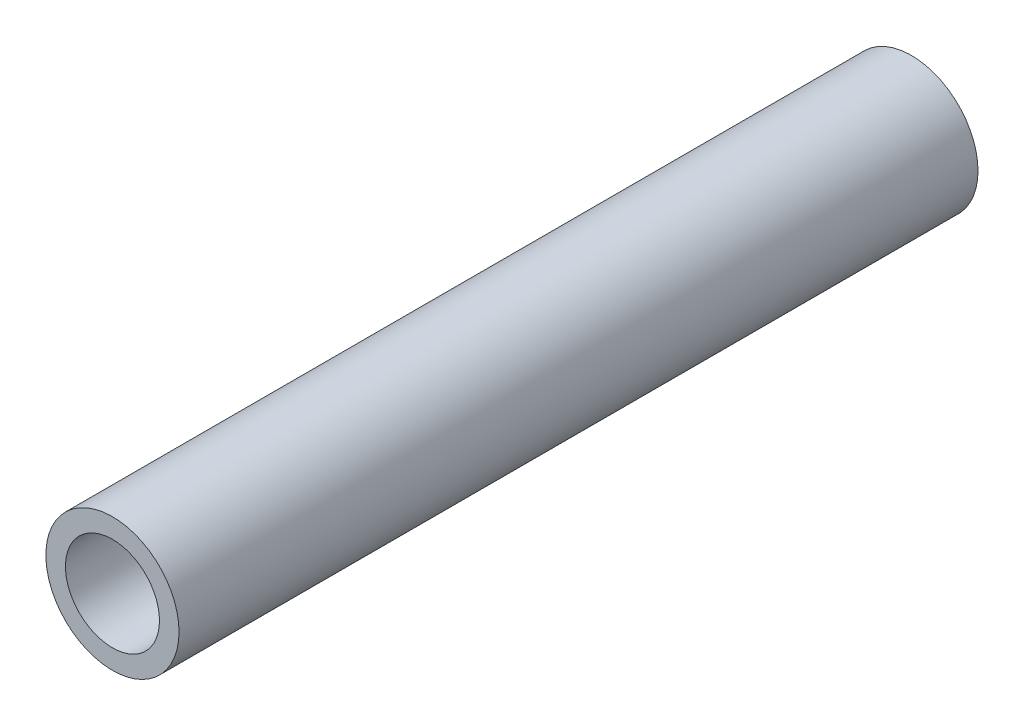
ISO-10303-21;
HEADER;
FILE_DESCRIPTION(('STEP AP214'),'2;1');
FILE_NAME('part.step','',(''),(''),'','','');
FILE_SCHEMA(('AUTOMOTIVE_DESIGN { 1 0 10303 214 1 1 1 1 }'));
ENDSEC;
DATA;
#1=APPLICATION_CONTEXT('core data for automotive mechanical design processes');
#2=APPLICATION_PROTOCOL_DEFINITION('international standard','automotive_design',2000,#1);
#3=PRODUCT_CONTEXT('',#1,'mechanical');
#4=PRODUCT('Part','Part','',(#3));
#5=PRODUCT_RELATED_PRODUCT_CATEGORY('part','',(#4));
#6=PRODUCT_DEFINITION_FORMATION('','',#4);
#7=PRODUCT_DEFINITION_CONTEXT('part definition',#1,'design');
#8=PRODUCT_DEFINITION('design','',#6,#7);
#9=PRODUCT_DEFINITION_SHAPE('','',#8);
#10=(LENGTH_UNIT() NAMED_UNIT(*) SI_UNIT(.MILLI.,.METRE.));
#11=(NAMED_UNIT(*) PLANE_ANGLE_UNIT() SI_UNIT($,.RADIAN.));
#12=(NAMED_UNIT(*) SI_UNIT($,.STERADIAN.) SOLID_ANGLE_UNIT());
#13=UNCERTAINTY_MEASURE_WITH_UNIT(LENGTH_MEASURE(1.E-05),#10,'distance_accuracy_value','');
#14=(GEOMETRIC_REPRESENTATION_CONTEXT(3) GLOBAL_UNCERTAINTY_ASSIGNED_CONTEXT((#13)) GLOBAL_UNIT_ASSIGNED_CONTEXT((#10,
#11,#12)) REPRESENTATION_CONTEXT('',''));
#15=CARTESIAN_POINT('',(0.,0.,0.));
#16=DIRECTION('',(0.,0.,1.));
#17=DIRECTION('',(1.,0.,0.));
#18=AXIS2_PLACEMENT_3D('',#15,#16,#17);
#19=CARTESIAN_POINT('',(0.,0.,76.2));
#20=DIRECTION('',(0.,0.,1.));
#21=DIRECTION('',(1.,0.,0.));
#22=AXIS2_PLACEMENT_3D('',#19,#20,#21);
#23=PLANE('',#22);
#24=CARTESIAN_POINT('',(0.,0.,76.2));
#25=DIRECTION('',(0.,0.,1.));
#26=DIRECTION('',(1.,0.,0.));
#27=AXIS2_PLACEMENT_3D('',#24,#25,#26);
#28=CIRCLE('',#27,6.35);
#29=CARTESIAN_POINT('',(6.35,0.,76.2));
#30=VERTEX_POINT('',#29);
#31=EDGE_CURVE('E10',#30,#30,#28,.T.);
#32=ORIENTED_EDGE('',*,*,#31,.T.);
#33=EDGE_LOOP('',(#32));
#34=FACE_BOUND('',#33,.T.);
#35=CARTESIAN_POINT('',(0.,0.,76.2));
#36=DIRECTION('',(0.,0.,1.));
#37=DIRECTION('',(1.,0.,0.));
#38=AXIS2_PLACEMENT_3D('',#35,#36,#37);
#39=CIRCLE('',#38,4.4831);
#40=CARTESIAN_POINT('',(4.4831,0.,76.2));
#41=VERTEX_POINT('',#40);
#42=EDGE_CURVE('E41',#41,#41,#39,.T.);
#43=ORIENTED_EDGE('',*,*,#42,.F.);
#44=EDGE_LOOP('',(#43));
#45=FACE_BOUND('',#44,.T.);
#46=ADVANCED_FACE('F30',(#34,#45),#23,.T.);
#47=CARTESIAN_POINT('',(0.,0.,0.));
#48=DIRECTION('',(0.,0.,1.));
#49=DIRECTION('',(1.,0.,0.));
#50=AXIS2_PLACEMENT_3D('',#47,#48,#49);
#51=PLANE('',#50);
#52=CARTESIAN_POINT('',(0.,0.,0.));
#53=DIRECTION('',(0.,0.,1.));
#54=DIRECTION('',(1.,0.,0.));
#55=AXIS2_PLACEMENT_3D('',#52,#53,#54);
#56=CIRCLE('',#55,6.35);
#57=CARTESIAN_POINT('',(6.35,0.,0.));
#58=VERTEX_POINT('',#57);
#59=EDGE_CURVE('E34',#58,#58,#56,.T.);
#60=ORIENTED_EDGE('',*,*,#59,.F.);
#61=EDGE_LOOP('',(#60));
#62=FACE_BOUND('',#61,.T.);
#63=CARTESIAN_POINT('',(0.,0.,0.));
#64=DIRECTION('',(0.,0.,1.));
#65=DIRECTION('',(1.,0.,0.));
#66=AXIS2_PLACEMENT_3D('',#63,#64,#65);
#67=CIRCLE('',#66,4.4831);
#68=CARTESIAN_POINT('',(4.4831,0.,0.));
#69=VERTEX_POINT('',#68);
#70=EDGE_CURVE('E43',#69,#69,#67,.T.);
#71=ORIENTED_EDGE('',*,*,#70,.T.);
#72=EDGE_LOOP('',(#71));
#73=FACE_BOUND('',#72,.T.);
#74=ADVANCED_FACE('F53',(#62,#73),#51,.F.);
#75=CARTESIAN_POINT('',(0.,0.,76.2));
#76=DIRECTION('',(0.,0.,-1.));
#77=DIRECTION('',(-1.,0.,0.));
#78=AXIS2_PLACEMENT_3D('',#75,#76,#77);
#79=CYLINDRICAL_SURFACE('',#78,6.35);
#80=ORIENTED_EDGE('',*,*,#31,.F.);
#81=EDGE_LOOP('',(#80));
#82=FACE_BOUND('',#81,.T.);
#83=ORIENTED_EDGE('',*,*,#59,.T.);
#84=EDGE_LOOP('',(#83));
#85=FACE_BOUND('',#84,.T.);
#86=ADVANCED_FACE('F32',(#82,#85),#79,.T.);
#87=CARTESIAN_POINT('',(0.,0.,76.2));
#88=DIRECTION('',(0.,0.,-1.));
#89=DIRECTION('',(-1.,0.,0.));
#90=AXIS2_PLACEMENT_3D('',#87,#88,#89);
#91=CYLINDRICAL_SURFACE('',#90,4.4831);
#92=ORIENTED_EDGE('',*,*,#42,.T.);
#93=EDGE_LOOP('',(#92));
#94=FACE_BOUND('',#93,.T.);
#95=ORIENTED_EDGE('',*,*,#70,.F.);
#96=EDGE_LOOP('',(#95));
#97=FACE_BOUND('',#96,.T.);
#98=ADVANCED_FACE('F49',(#94,#97),#91,.F.);
#99=CLOSED_SHELL('',(#46,#74,#86,#98));
#100=MANIFOLD_SOLID_BREP('B2',#99);
#101=ADVANCED_BREP_SHAPE_REPRESENTATION('',(#18,#100),#14);
#102=SHAPE_DEFINITION_REPRESENTATION(#9,#101);
ENDSEC;
END-ISO-10303-21;
